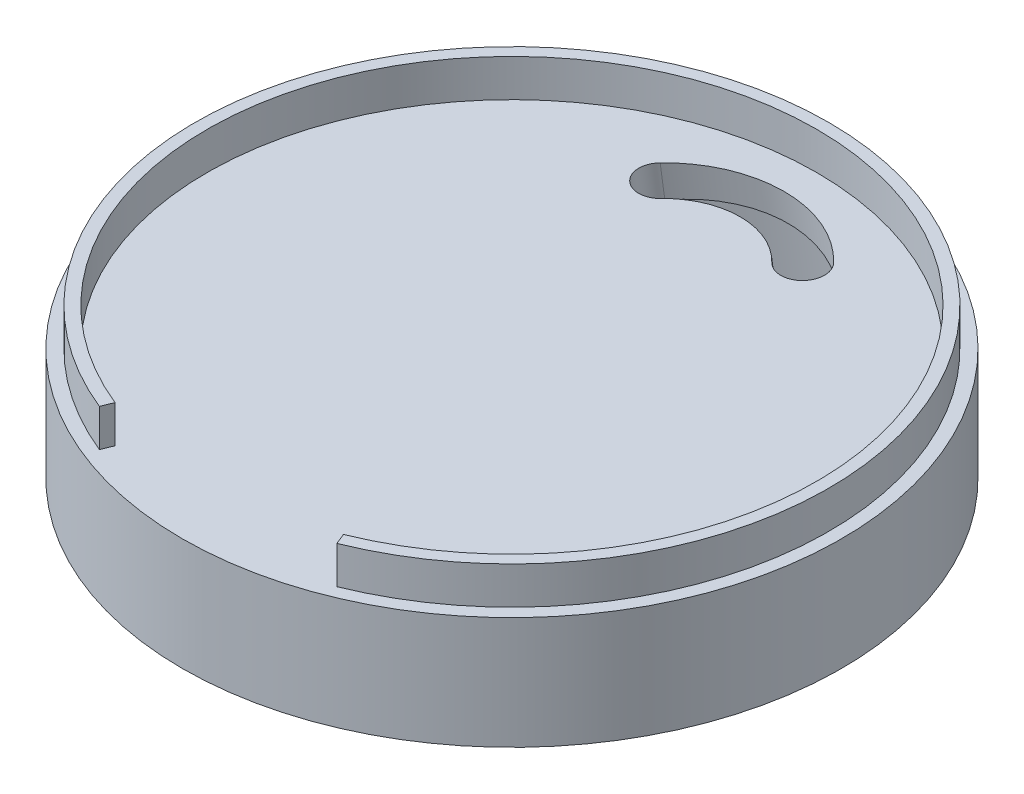
ISO-10303-21;
HEADER;
FILE_DESCRIPTION(('STEP AP214'),'2;1');
FILE_NAME('part.step','',(''),(''),'','','');
FILE_SCHEMA(('AUTOMOTIVE_DESIGN { 1 0 10303 214 1 1 1 1 }'));
ENDSEC;
DATA;
#1=APPLICATION_CONTEXT('core data for automotive mechanical design processes');
#2=APPLICATION_PROTOCOL_DEFINITION('international standard','automotive_design',2000,#1);
#3=PRODUCT_CONTEXT('',#1,'mechanical');
#4=PRODUCT('Part','Part','',(#3));
#5=PRODUCT_RELATED_PRODUCT_CATEGORY('part','',(#4));
#6=PRODUCT_DEFINITION_FORMATION('','',#4);
#7=PRODUCT_DEFINITION_CONTEXT('part definition',#1,'design');
#8=PRODUCT_DEFINITION('design','',#6,#7);
#9=PRODUCT_DEFINITION_SHAPE('','',#8);
#10=(LENGTH_UNIT() NAMED_UNIT(*) SI_UNIT(.MILLI.,.METRE.));
#11=(NAMED_UNIT(*) PLANE_ANGLE_UNIT() SI_UNIT($,.RADIAN.));
#12=(NAMED_UNIT(*) SI_UNIT($,.STERADIAN.) SOLID_ANGLE_UNIT());
#13=UNCERTAINTY_MEASURE_WITH_UNIT(LENGTH_MEASURE(1.E-05),#10,'distance_accuracy_value','');
#14=(GEOMETRIC_REPRESENTATION_CONTEXT(3) GLOBAL_UNCERTAINTY_ASSIGNED_CONTEXT((#13)) GLOBAL_UNIT_ASSIGNED_CONTEXT((#10,
#11,#12)) REPRESENTATION_CONTEXT('',''));
#15=CARTESIAN_POINT('',(0.,0.,0.));
#16=DIRECTION('',(0.,0.,1.));
#17=DIRECTION('',(1.,0.,0.));
#18=AXIS2_PLACEMENT_3D('',#15,#16,#17);
#19=CARTESIAN_POINT('',(0.,4.89963636339587,0.668132231372164));
#20=DIRECTION('',(0.,-0.990830168044299,-0.135113204733314));
#21=DIRECTION('',(0.,0.135113204733314,-0.990830168044299));
#22=AXIS2_PLACEMENT_3D('',#19,#20,#21);
#23=TOROIDAL_SURFACE('',#22,39.,1.);
#24=CARTESIAN_POINT('',(0.,5.89046653144017,0.803245436105478));
#25=DIRECTION('',(0.,-0.990830168044299,-0.135113204733314));
#26=DIRECTION('',(0.,0.135113204733314,-0.990830168044299));
#27=AXIS2_PLACEMENT_3D('',#24,#25,#26);
#28=CIRCLE('',#27,39.);
#29=CARTESIAN_POINT('',(0.,11.1598815160394,-37.8391311176222));
#30=VERTEX_POINT('',#29);
#31=EDGE_CURVE('E182',#30,#30,#28,.T.);
#32=ORIENTED_EDGE('',*,*,#31,.F.);
#33=EDGE_LOOP('',(#32));
#34=FACE_BOUND('',#33,.T.);
#35=CARTESIAN_POINT('',(-16.8813730638866,0.,36.5987988962752));
#36=CARTESIAN_POINT('',(-16.5794856015466,0.,36.7406302800024));
#37=CARTESIAN_POINT('',(-16.2756295246718,0.,36.878153996685));
#38=CARTESIAN_POINT('',(-15.6642064968074,0.,37.1446697684608));
#39=CARTESIAN_POINT('',(-15.3566396365368,0.,37.2736620316285));
#40=CARTESIAN_POINT('',(-13.8032257242076,0.,37.9002763107247));
#41=CARTESIAN_POINT('',(-12.5308241489744,0.,38.3338424882835));
#42=CARTESIAN_POINT('',(-9.94610805296166,0.,39.0676245332188));
#43=CARTESIAN_POINT('',(-8.63371943546764,0.,39.3675744448832));
#44=CARTESIAN_POINT('',(-6.14855697711686,0.,39.8077188264299));
#45=CARTESIAN_POINT('',(-4.97842457587731,0.,39.963005958262));
#46=CARTESIAN_POINT('',(-2.62882000395269,0.,40.1748158604644));
#47=CARTESIAN_POINT('',(-1.44934428849859,0.,40.2312991463402));
#48=CARTESIAN_POINT('',(0.910418579506078,0.,40.2462516535322));
#49=CARTESIAN_POINT('',(2.09070583768441,0.,40.204703782583));
#50=CARTESIAN_POINT('',(4.44370164354831,0.,40.0229049301352));
#51=CARTESIAN_POINT('',(5.6164103472022,0.,39.8826559864967));
#52=CARTESIAN_POINT('',(7.94840690090944,0.,39.50113991183));
#53=CARTESIAN_POINT('',(9.10765281673493,0.,39.2596156544282));
#54=CARTESIAN_POINT('',(11.399651440024,0.,38.6731899218117));
#55=CARTESIAN_POINT('',(12.5324130664936,0.,38.3283238053553));
#56=CARTESIAN_POINT('',(14.2042511026774,0.,37.7315226386141));
#57=CARTESIAN_POINT('',(14.7576518645712,0.,37.5190241693542));
#58=CARTESIAN_POINT('',(15.8534158146962,0.,37.0672288486971));
#59=CARTESIAN_POINT('',(16.3957797615377,0.,36.8279338465492));
#60=CARTESIAN_POINT('',(17.4684517948963,0.,36.3218840070835));
#61=CARTESIAN_POINT('',(17.9987432011531,0.,36.0550936949929));
#62=CARTESIAN_POINT('',(18.7830985071646,0.,35.6341996438728));
#63=CARTESIAN_POINT('',(19.0427437305784,0.,35.4904256767947));
#64=CARTESIAN_POINT('',(19.5580557419027,0.,35.1958907282394));
#65=CARTESIAN_POINT('',(19.8137223407993,0.,35.0451294161576));
#66=CARTESIAN_POINT('',(20.0672601141124,0.,34.8908339088547));
#67=B_SPLINE_CURVE_WITH_KNOTS('',3,(#35,#36,#37,#38,#39,#40,#41,#42,#43,#44,#45,#46,#47,#48,#49,
#50,#51,#52,#53,#54,#55,#56,#57,#58,#59,#60,#61,#62,#63,#64,#65,#66),.UNSPECIFIED.,.F.,.F.,(4,2,
2,2,2,2,2,2,2,2,2,2,2,2,2,4),(0.,1.00050383823659,2.00098326609496,6.02499713971548,
10.0569851850233,13.5939438959018,17.13231574154,20.6713045671391,24.2102203261299,
27.7581759139204,31.3049189404103,33.0827243774805,34.8604072023561,36.6404130309668,
37.5306992411513,38.4210276181205),.UNSPECIFIED.);
#68=CARTESIAN_POINT('',(-16.8813730638866,0.,36.5987988962752));
#69=VERTEX_POINT('',#68);
#70=CARTESIAN_POINT('',(16.8813730638866,0.,36.5987988962752));
#71=VERTEX_POINT('',#70);
#72=EDGE_CURVE('E11',#69,#71,#67,.T.);
#73=ORIENTED_EDGE('',*,*,#72,.F.);
#74=CARTESIAN_POINT('',(0.,4.89963636339587,0.668132231372164));
#75=DIRECTION('',(0.,-0.990830168044299,-0.135113204733314));
#76=DIRECTION('',(0.,0.135113204733314,-0.990830168044299));
#77=AXIS2_PLACEMENT_3D('',#74,#75,#76);
#78=CIRCLE('',#77,40.);
#79=EDGE_CURVE('E47',#71,#69,#78,.F.);
#80=ORIENTED_EDGE('',*,*,#79,.F.);
#81=EDGE_LOOP('',(#73,#80));
#82=FACE_BOUND('',#81,.T.);
#83=ADVANCED_FACE('F34',(#34,#82),#23,.F.);
#84=CARTESIAN_POINT('',(0.,5.89046653144017,0.803245436105478));
#85=DIRECTION('',(0.,-0.990830168044299,-0.135113204733314));
#86=DIRECTION('',(0.,0.135113204733314,-0.990830168044299));
#87=AXIS2_PLACEMENT_3D('',#84,#85,#86);
#88=PLANE('',#87);
#89=CARTESIAN_POINT('',(0.,5.89046653144017,0.803245436105478));
#90=DIRECTION('',(0.,-0.990830168044299,-0.135113204733314));
#91=DIRECTION('',(0.,0.135113204733314,-0.990830168044299));
#92=AXIS2_PLACEMENT_3D('',#89,#90,#91);
#93=CIRCLE('',#92,4.47213595499958);
#94=CARTESIAN_POINT('',(0.,6.49471115232324,-3.62788178370371));
#95=VERTEX_POINT('',#94);
#96=EDGE_CURVE('E412',#95,#95,#93,.T.);
#97=ORIENTED_EDGE('',*,*,#96,.F.);
#98=EDGE_LOOP('',(#97));
#99=FACE_BOUND('',#98,.T.);
#100=ORIENTED_EDGE('',*,*,#31,.T.);
#101=EDGE_LOOP('',(#100));
#102=FACE_BOUND('',#101,.T.);
#103=CARTESIAN_POINT('',(-9.48798461322163,10.091385007234,-30.0034900530494));
#104=DIRECTION('',(0.,-0.990830168044299,-0.135113204733314));
#105=DIRECTION('',(0.,0.135113204733314,-0.990830168044299));
#106=AXIS2_PLACEMENT_3D('',#103,#104,#105);
#107=CIRCLE('',#106,2.90577590099089);
#108=CARTESIAN_POINT('',(-7.3948638104945,9.81905969605829,-28.006437771094));
#109=VERTEX_POINT('',#108);
#110=CARTESIAN_POINT('',(-11.5811054159488,10.3637103184098,-32.0005423350049));
#111=VERTEX_POINT('',#110);
#112=EDGE_CURVE('E127',#109,#111,#107,.T.);
#113=ORIENTED_EDGE('',*,*,#112,.F.);
#114=CARTESIAN_POINT('',(0.,8.85695154364236,-20.9509779867106));
#115=DIRECTION('',(0.,0.990830168044299,0.135113204733314));
#116=DIRECTION('',(0.,0.135113204733314,-0.990830168044299));
#117=AXIS2_PLACEMENT_3D('',#114,#115,#116);
#118=CIRCLE('',#117,10.2659230292146);
#119=CARTESIAN_POINT('',(7.3948638104945,9.81905969605829,-28.006437771094));
#120=VERTEX_POINT('',#119);
#121=EDGE_CURVE('E132',#120,#109,#118,.T.);
#122=ORIENTED_EDGE('',*,*,#121,.F.);
#123=CARTESIAN_POINT('',(9.48798461322163,10.091385007234,-30.0034900530494));
#124=DIRECTION('',(0.,-0.990830168044299,-0.135113204733314));
#125=DIRECTION('',(0.,0.135113204733314,-0.990830168044299));
#126=AXIS2_PLACEMENT_3D('',#123,#124,#125);
#127=CIRCLE('',#126,2.90577590099089);
#128=CARTESIAN_POINT('',(11.5811054159488,10.3637103184098,-32.0005423350049));
#129=VERTEX_POINT('',#128);
#130=EDGE_CURVE('E111',#129,#120,#127,.T.);
#131=ORIENTED_EDGE('',*,*,#130,.F.);
#132=CARTESIAN_POINT('',(0.,8.85695154364236,-20.9509779867106));
#133=DIRECTION('',(0.,-0.990830168044299,-0.135113204733314));
#134=DIRECTION('',(0.,0.135113204733314,-0.990830168044299));
#135=AXIS2_PLACEMENT_3D('',#132,#133,#134);
#136=CIRCLE('',#135,16.0774748311964);
#137=EDGE_CURVE('E122',#111,#129,#136,.T.);
#138=ORIENTED_EDGE('',*,*,#137,.F.);
#139=EDGE_LOOP('',(#113,#122,#131,#138));
#140=FACE_BOUND('',#139,.T.);
#141=CARTESIAN_POINT('',(-14.3707878685504,4.13399486990709,13.6840376206814));
#142=DIRECTION('',(0.,-0.990830168044299,-0.135113204733314));
#143=DIRECTION('',(0.,0.135113204733314,-0.990830168044299));
#144=AXIS2_PLACEMENT_3D('',#141,#142,#143);
#145=CIRCLE('',#144,3.);
#146=CARTESIAN_POINT('',(-14.3707878685504,4.53933448410703,10.7115471165485));
#147=VERTEX_POINT('',#146);
#148=EDGE_CURVE('E416',#147,#147,#145,.T.);
#149=ORIENTED_EDGE('',*,*,#148,.F.);
#150=EDGE_LOOP('',(#149));
#151=FACE_BOUND('',#150,.T.);
#152=CARTESIAN_POINT('',(14.3707878685504,4.13399486990709,13.6840376206814));
#153=DIRECTION('',(0.,0.990830168044299,0.135113204733314));
#154=DIRECTION('',(0.,-0.135113204733314,0.990830168044299));
#155=AXIS2_PLACEMENT_3D('',#152,#153,#154);
#156=CIRCLE('',#155,3.);
#157=CARTESIAN_POINT('',(14.3707878685504,3.72865525570715,16.6565281248143));
#158=VERTEX_POINT('',#157);
#159=EDGE_CURVE('E422',#158,#158,#156,.T.);
#160=ORIENTED_EDGE('',*,*,#159,.T.);
#161=EDGE_LOOP('',(#160));
#162=FACE_BOUND('',#161,.T.);
#163=ADVANCED_FACE('F129',(#99,#102,#140,#151,#162),#88,.T.);
#164=CARTESIAN_POINT('',(0.,15.,0.));
#165=DIRECTION('',(0.,1.,0.));
#166=DIRECTION('',(0.,0.,1.));
#167=AXIS2_PLACEMENT_3D('',#164,#165,#166);
#168=PLANE('',#167);
#169=CARTESIAN_POINT('',(-9.48798461322163,15.,-29.3341334631268));
#170=DIRECTION('',(0.,1.,0.));
#171=DIRECTION('',(0.,0.,-1.));
#172=AXIS2_PLACEMENT_3D('',#169,#170,#171);
#173=ELLIPSE('',#172,2.93266797348966,2.90577590099089);
#174=CARTESIAN_POINT('',(-11.5811054159488,15.,-31.368321014788));
#175=VERTEX_POINT('',#174);
#176=CARTESIAN_POINT('',(-7.3948638104945,15.,-27.2999459114656));
#177=VERTEX_POINT('',#176);
#178=EDGE_CURVE('E146',#175,#177,#173,.T.);
#179=ORIENTED_EDGE('',*,*,#178,.F.);
#180=CARTESIAN_POINT('',(0.,15.,-20.1132895608436));
#181=DIRECTION('',(0.,1.,0.));
#182=DIRECTION('',(0.,0.,-1.));
#183=AXIS2_PLACEMENT_3D('',#180,#181,#182);
#184=ELLIPSE('',#183,16.2262669726035,16.0774748311964);
#185=CARTESIAN_POINT('',(11.5811054159488,15.,-31.368321014788));
#186=VERTEX_POINT('',#185);
#187=EDGE_CURVE('E139',#186,#175,#184,.T.);
#188=ORIENTED_EDGE('',*,*,#187,.F.);
#189=CARTESIAN_POINT('',(9.48798461322163,15.,-29.3341334631268));
#190=DIRECTION('',(0.,1.,0.));
#191=DIRECTION('',(0.,0.,-1.));
#192=AXIS2_PLACEMENT_3D('',#189,#190,#191);
#193=ELLIPSE('',#192,2.93266797348966,2.90577590099089);
#194=CARTESIAN_POINT('',(7.3948638104945,15.,-27.2999459114656));
#195=VERTEX_POINT('',#194);
#196=EDGE_CURVE('E114',#195,#186,#193,.T.);
#197=ORIENTED_EDGE('',*,*,#196,.F.);
#198=CARTESIAN_POINT('',(0.,15.,-20.1132895608436));
#199=DIRECTION('',(0.,1.,0.));
#200=DIRECTION('',(0.,0.,-1.));
#201=AXIS2_PLACEMENT_3D('',#198,#199,#200);
#202=ELLIPSE('',#201,10.3609310256242,10.2659230292146);
#203=EDGE_CURVE('E144',#177,#195,#202,.F.);
#204=ORIENTED_EDGE('',*,*,#203,.F.);
#205=EDGE_LOOP('',(#179,#188,#197,#204));
#206=FACE_BOUND('',#205,.T.);
#207=CARTESIAN_POINT('',(0.,15.,0.));
#208=DIRECTION('',(0.,1.,0.));
#209=DIRECTION('',(0.,0.,1.));
#210=AXIS2_PLACEMENT_3D('',#207,#208,#209);
#211=CIRCLE('',#210,44.);
#212=CARTESIAN_POINT('',(0.,15.,44.));
#213=VERTEX_POINT('',#212);
#214=EDGE_CURVE('E179',#213,#213,#211,.T.);
#215=ORIENTED_EDGE('',*,*,#214,.T.);
#216=EDGE_LOOP('',(#215));
#217=FACE_BOUND('',#216,.T.);
#218=DIRECTION('',(0.374606593415913,0.,0.927183854566787));
#219=VECTOR('',#218,1.);
#220=CARTESIAN_POINT('',(15.2464883520277,15.,37.7363828808682));
#221=LINE('',#220,#219);
#222=CARTESIAN_POINT('',(15.2464883520277,15.,37.7363828808682));
#223=VERTEX_POINT('',#222);
#224=CARTESIAN_POINT('',(15.8458589014931,15.,39.2198770481751));
#225=VERTEX_POINT('',#224);
#226=EDGE_CURVE('E163',#223,#225,#221,.T.);
#227=ORIENTED_EDGE('',*,*,#226,.F.);
#228=CARTESIAN_POINT('',(0.,15.,0.));
#229=DIRECTION('',(0.,-1.,0.));
#230=DIRECTION('',(0.,0.,1.));
#231=AXIS2_PLACEMENT_3D('',#228,#229,#230);
#232=CIRCLE('',#231,40.7);
#233=CARTESIAN_POINT('',(-15.2464883520276,15.,37.7363828808682));
#234=VERTEX_POINT('',#233);
#235=EDGE_CURVE('E160',#234,#223,#232,.T.);
#236=ORIENTED_EDGE('',*,*,#235,.F.);
#237=DIRECTION('',(0.374606593415912,0.,-0.927183854566788));
#238=VECTOR('',#237,1.);
#239=CARTESIAN_POINT('',(-15.2464883520276,15.,37.7363828808682));
#240=LINE('',#239,#238);
#241=CARTESIAN_POINT('',(-15.8458589014931,15.,39.2198770481751));
#242=VERTEX_POINT('',#241);
#243=EDGE_CURVE('E153',#242,#234,#240,.T.);
#244=ORIENTED_EDGE('',*,*,#243,.F.);
#245=CARTESIAN_POINT('',(0.,15.,0.));
#246=DIRECTION('',(0.,1.,0.));
#247=DIRECTION('',(0.,0.,1.));
#248=AXIS2_PLACEMENT_3D('',#245,#246,#247);
#249=CIRCLE('',#248,42.3);
#250=EDGE_CURVE('E165',#225,#242,#249,.T.);
#251=ORIENTED_EDGE('',*,*,#250,.F.);
#252=EDGE_LOOP('',(#227,#236,#244,#251));
#253=FACE_BOUND('',#252,.T.);
#254=ADVANCED_FACE('F198',(#206,#217,#253),#168,.T.);
#255=CARTESIAN_POINT('',(0.,15.,0.));
#256=DIRECTION('',(0.,-1.,0.));
#257=DIRECTION('',(0.,0.,-1.));
#258=AXIS2_PLACEMENT_3D('',#255,#256,#257);
#259=CYLINDRICAL_SURFACE('',#258,44.);
#260=ORIENTED_EDGE('',*,*,#214,.F.);
#261=EDGE_LOOP('',(#260));
#262=FACE_BOUND('',#261,.T.);
#263=CARTESIAN_POINT('',(0.,0.,0.));
#264=DIRECTION('',(0.,1.,0.));
#265=DIRECTION('',(0.,0.,1.));
#266=AXIS2_PLACEMENT_3D('',#263,#264,#265);
#267=CIRCLE('',#266,44.);
#268=CARTESIAN_POINT('',(0.,0.,44.));
#269=VERTEX_POINT('',#268);
#270=EDGE_CURVE('E178',#269,#269,#267,.T.);
#271=ORIENTED_EDGE('',*,*,#270,.T.);
#272=EDGE_LOOP('',(#271));
#273=FACE_BOUND('',#272,.T.);
#274=ADVANCED_FACE('F194',(#262,#273),#259,.T.);
#275=CARTESIAN_POINT('',(0.,0.,0.));
#276=DIRECTION('',(0.,1.,0.));
#277=DIRECTION('',(0.,0.,1.));
#278=AXIS2_PLACEMENT_3D('',#275,#276,#277);
#279=PLANE('',#278);
#280=CARTESIAN_POINT('',(0.,0.,0.));
#281=DIRECTION('',(0.,1.,0.));
#282=DIRECTION('',(0.,0.,1.));
#283=AXIS2_PLACEMENT_3D('',#280,#281,#282);
#284=ELLIPSE('',#283,40.3701878384991,40.);
#285=EDGE_CURVE('E148',#69,#71,#284,.F.);
#286=ORIENTED_EDGE('',*,*,#285,.F.);
#287=ORIENTED_EDGE('',*,*,#72,.T.);
#288=EDGE_LOOP('',(#286,#287));
#289=FACE_BOUND('',#288,.T.);
#290=ORIENTED_EDGE('',*,*,#270,.F.);
#291=EDGE_LOOP('',(#290));
#292=FACE_BOUND('',#291,.T.);
#293=ADVANCED_FACE('F190',(#289,#292),#279,.F.);
#294=CARTESIAN_POINT('',(0.,20.,0.));
#295=DIRECTION('',(0.,-1.,0.));
#296=DIRECTION('',(0.,0.,-1.));
#297=AXIS2_PLACEMENT_3D('',#294,#295,#296);
#298=CYLINDRICAL_SURFACE('',#297,40.7);
#299=ORIENTED_EDGE('',*,*,#235,.T.);
#300=DIRECTION('',(0.,-1.,0.));
#301=VECTOR('',#300,1.);
#302=CARTESIAN_POINT('',(15.2464883520277,20.,37.7363828808682));
#303=LINE('',#302,#301);
#304=CARTESIAN_POINT('',(15.2464883520277,20.,37.7363828808682));
#305=VERTEX_POINT('',#304);
#306=EDGE_CURVE('E176',#305,#223,#303,.T.);
#307=ORIENTED_EDGE('',*,*,#306,.F.);
#308=CARTESIAN_POINT('',(0.,20.,0.));
#309=DIRECTION('',(0.,-1.,0.));
#310=DIRECTION('',(0.,0.,1.));
#311=AXIS2_PLACEMENT_3D('',#308,#309,#310);
#312=CIRCLE('',#311,40.7);
#313=CARTESIAN_POINT('',(-15.2464883520276,20.,37.7363828808682));
#314=VERTEX_POINT('',#313);
#315=EDGE_CURVE('E149',#314,#305,#312,.T.);
#316=ORIENTED_EDGE('',*,*,#315,.F.);
#317=DIRECTION('',(0.,-1.,0.));
#318=VECTOR('',#317,1.);
#319=CARTESIAN_POINT('',(-15.2464883520276,20.,37.7363828808682));
#320=LINE('',#319,#318);
#321=EDGE_CURVE('E159',#314,#234,#320,.T.);
#322=ORIENTED_EDGE('',*,*,#321,.T.);
#323=EDGE_LOOP('',(#299,#307,#316,#322));
#324=FACE_BOUND('',#323,.T.);
#325=ADVANCED_FACE('F193',(#324),#298,.F.);
#326=CARTESIAN_POINT('',(15.2464883520277,20.,37.7363828808682));
#327=DIRECTION('',(0.927183854566787,0.,-0.374606593415913));
#328=DIRECTION('',(-0.374606593415914,0.,-0.927183854566787));
#329=AXIS2_PLACEMENT_3D('',#326,#327,#328);
#330=PLANE('',#329);
#331=ORIENTED_EDGE('',*,*,#226,.T.);
#332=DIRECTION('',(0.,-1.,0.));
#333=VECTOR('',#332,1.);
#334=CARTESIAN_POINT('',(15.8458589014931,20.,39.2198770481751));
#335=LINE('',#334,#333);
#336=CARTESIAN_POINT('',(15.8458589014931,20.,39.2198770481751));
#337=VERTEX_POINT('',#336);
#338=EDGE_CURVE('E173',#337,#225,#335,.T.);
#339=ORIENTED_EDGE('',*,*,#338,.F.);
#340=DIRECTION('',(0.374606593415913,0.,0.927183854566787));
#341=VECTOR('',#340,1.);
#342=CARTESIAN_POINT('',(15.2464883520277,20.,37.7363828808682));
#343=LINE('',#342,#341);
#344=EDGE_CURVE('E152',#305,#337,#343,.T.);
#345=ORIENTED_EDGE('',*,*,#344,.F.);
#346=ORIENTED_EDGE('',*,*,#306,.T.);
#347=EDGE_LOOP('',(#331,#339,#345,#346));
#348=FACE_BOUND('',#347,.T.);
#349=ADVANCED_FACE('F235',(#348),#330,.F.);
#350=CARTESIAN_POINT('',(0.,20.,0.));
#351=DIRECTION('',(0.,-1.,0.));
#352=DIRECTION('',(0.,0.,-1.));
#353=AXIS2_PLACEMENT_3D('',#350,#351,#352);
#354=CYLINDRICAL_SURFACE('',#353,42.3);
#355=ORIENTED_EDGE('',*,*,#250,.T.);
#356=DIRECTION('',(0.,-1.,0.));
#357=VECTOR('',#356,1.);
#358=CARTESIAN_POINT('',(-15.8458589014931,20.,39.2198770481751));
#359=LINE('',#358,#357);
#360=CARTESIAN_POINT('',(-15.8458589014931,20.,39.2198770481751));
#361=VERTEX_POINT('',#360);
#362=EDGE_CURVE('E171',#361,#242,#359,.T.);
#363=ORIENTED_EDGE('',*,*,#362,.F.);
#364=CARTESIAN_POINT('',(0.,20.,0.));
#365=DIRECTION('',(0.,1.,0.));
#366=DIRECTION('',(0.,0.,1.));
#367=AXIS2_PLACEMENT_3D('',#364,#365,#366);
#368=CIRCLE('',#367,42.3);
#369=EDGE_CURVE('E155',#337,#361,#368,.T.);
#370=ORIENTED_EDGE('',*,*,#369,.F.);
#371=ORIENTED_EDGE('',*,*,#338,.T.);
#372=EDGE_LOOP('',(#355,#363,#370,#371));
#373=FACE_BOUND('',#372,.T.);
#374=ADVANCED_FACE('F231',(#373),#354,.T.);
#375=CARTESIAN_POINT('',(-15.2464883520276,20.,37.7363828808682));
#376=DIRECTION('',(-0.927183854566788,0.,-0.374606593415912));
#377=DIRECTION('',(-0.374606593415912,0.,0.927183854566788));
#378=AXIS2_PLACEMENT_3D('',#375,#376,#377);
#379=PLANE('',#378);
#380=ORIENTED_EDGE('',*,*,#243,.T.);
#381=ORIENTED_EDGE('',*,*,#321,.F.);
#382=DIRECTION('',(0.374606593415912,0.,-0.927183854566788));
#383=VECTOR('',#382,1.);
#384=CARTESIAN_POINT('',(-15.2464883520276,20.,37.7363828808682));
#385=LINE('',#384,#383);
#386=EDGE_CURVE('E157',#361,#314,#385,.T.);
#387=ORIENTED_EDGE('',*,*,#386,.F.);
#388=ORIENTED_EDGE('',*,*,#362,.T.);
#389=EDGE_LOOP('',(#380,#381,#387,#388));
#390=FACE_BOUND('',#389,.T.);
#391=ADVANCED_FACE('F227',(#390),#379,.F.);
#392=CARTESIAN_POINT('',(0.,20.,0.));
#393=DIRECTION('',(0.,1.,0.));
#394=DIRECTION('',(0.,0.,1.));
#395=AXIS2_PLACEMENT_3D('',#392,#393,#394);
#396=PLANE('',#395);
#397=ORIENTED_EDGE('',*,*,#315,.T.);
#398=ORIENTED_EDGE('',*,*,#344,.T.);
#399=ORIENTED_EDGE('',*,*,#369,.T.);
#400=ORIENTED_EDGE('',*,*,#386,.T.);
#401=EDGE_LOOP('',(#397,#398,#399,#400));
#402=FACE_BOUND('',#401,.T.);
#403=ADVANCED_FACE('F224',(#402),#396,.T.);
#404=CARTESIAN_POINT('',(0.,-13.9261368294458,-1.89901865856079));
#405=DIRECTION('',(0.,0.990830168044299,0.135113204733314));
#406=DIRECTION('',(0.,-0.135113204733314,0.990830168044299));
#407=AXIS2_PLACEMENT_3D('',#404,#405,#406);
#408=CYLINDRICAL_SURFACE('',#407,40.);
#409=ORIENTED_EDGE('',*,*,#285,.T.);
#410=ORIENTED_EDGE('',*,*,#79,.T.);
#411=EDGE_LOOP('',(#409,#410));
#412=FACE_BOUND('',#411,.T.);
#413=ADVANCED_FACE('F189',(#412),#408,.F.);
#414=CARTESIAN_POINT('',(-9.48798461322163,19.999686687677,-28.6523580057163));
#415=DIRECTION('',(0.,-0.990830168044299,-0.135113204733314));
#416=DIRECTION('',(0.,0.135113204733314,-0.990830168044299));
#417=AXIS2_PLACEMENT_3D('',#414,#415,#416);
#418=CYLINDRICAL_SURFACE('',#417,2.90577590099089);
#419=ORIENTED_EDGE('',*,*,#178,.T.);
#420=DIRECTION('',(0.,-0.990830168044299,-0.135113204733314));
#421=VECTOR('',#420,1.);
#422=CARTESIAN_POINT('',(-7.3948638104945,19.7273613765013,-26.6553057237609));
#423=LINE('',#422,#421);
#424=EDGE_CURVE('E137',#177,#109,#423,.T.);
#425=ORIENTED_EDGE('',*,*,#424,.T.);
#426=ORIENTED_EDGE('',*,*,#112,.T.);
#427=DIRECTION('',(0.,-0.990830168044299,-0.135113204733314));
#428=VECTOR('',#427,1.);
#429=CARTESIAN_POINT('',(-11.5811054159488,20.2720119988528,-30.6494102876717));
#430=LINE('',#429,#428);
#431=EDGE_CURVE('E118',#175,#111,#430,.T.);
#432=ORIENTED_EDGE('',*,*,#431,.F.);
#433=EDGE_LOOP('',(#419,#425,#426,#432));
#434=FACE_BOUND('',#433,.T.);
#435=ADVANCED_FACE('F220',(#434),#418,.F.);
#436=CARTESIAN_POINT('',(0.,18.7652532240853,-19.5998459393774));
#437=DIRECTION('',(0.,-0.990830168044299,-0.135113204733314));
#438=DIRECTION('',(0.,0.135113204733314,-0.990830168044299));
#439=AXIS2_PLACEMENT_3D('',#436,#437,#438);
#440=CYLINDRICAL_SURFACE('',#439,10.2659230292146);
#441=ORIENTED_EDGE('',*,*,#203,.T.);
#442=DIRECTION('',(0.,-0.990830168044299,-0.135113204733314));
#443=VECTOR('',#442,1.);
#444=CARTESIAN_POINT('',(7.3948638104945,19.7273613765013,-26.6553057237609));
#445=LINE('',#444,#443);
#446=EDGE_CURVE('E117',#195,#120,#445,.T.);
#447=ORIENTED_EDGE('',*,*,#446,.T.);
#448=ORIENTED_EDGE('',*,*,#121,.T.);
#449=ORIENTED_EDGE('',*,*,#424,.F.);
#450=EDGE_LOOP('',(#441,#447,#448,#449));
#451=FACE_BOUND('',#450,.T.);
#452=ADVANCED_FACE('F287',(#451),#440,.T.);
#453=CARTESIAN_POINT('',(9.48798461322163,19.999686687677,-28.6523580057163));
#454=DIRECTION('',(0.,-0.990830168044299,-0.135113204733314));
#455=DIRECTION('',(0.,0.135113204733314,-0.990830168044299));
#456=AXIS2_PLACEMENT_3D('',#453,#454,#455);
#457=CYLINDRICAL_SURFACE('',#456,2.90577590099089);
#458=ORIENTED_EDGE('',*,*,#196,.T.);
#459=DIRECTION('',(0.,-0.990830168044299,-0.135113204733314));
#460=VECTOR('',#459,1.);
#461=CARTESIAN_POINT('',(11.5811054159488,20.2720119988528,-30.6494102876717));
#462=LINE('',#461,#460);
#463=EDGE_CURVE('E106',#186,#129,#462,.T.);
#464=ORIENTED_EDGE('',*,*,#463,.T.);
#465=ORIENTED_EDGE('',*,*,#130,.T.);
#466=ORIENTED_EDGE('',*,*,#446,.F.);
#467=EDGE_LOOP('',(#458,#464,#465,#466));
#468=FACE_BOUND('',#467,.T.);
#469=ADVANCED_FACE('F108',(#468),#457,.F.);
#470=CARTESIAN_POINT('',(0.,18.7652532240853,-19.5998459393774));
#471=DIRECTION('',(0.,-0.990830168044299,-0.135113204733314));
#472=DIRECTION('',(0.,0.135113204733314,-0.990830168044299));
#473=AXIS2_PLACEMENT_3D('',#470,#471,#472);
#474=CYLINDRICAL_SURFACE('',#473,16.0774748311964);
#475=ORIENTED_EDGE('',*,*,#187,.T.);
#476=ORIENTED_EDGE('',*,*,#431,.T.);
#477=ORIENTED_EDGE('',*,*,#137,.T.);
#478=ORIENTED_EDGE('',*,*,#463,.F.);
#479=EDGE_LOOP('',(#475,#476,#477,#478));
#480=FACE_BOUND('',#479,.T.);
#481=ADVANCED_FACE('F123',(#480),#474,.F.);
#482=CARTESIAN_POINT('',(-14.3707878685504,7.10648537403999,14.0893772348813));
#483=DIRECTION('',(0.,-0.990830168044299,-0.135113204733314));
#484=DIRECTION('',(0.,0.135113204733314,-0.990830168044299));
#485=AXIS2_PLACEMENT_3D('',#482,#483,#484);
#486=CYLINDRICAL_SURFACE('',#485,3.);
#487=CARTESIAN_POINT('',(-14.3707878685504,7.10648537403999,14.0893772348813));
#488=DIRECTION('',(0.,-0.990830168044299,-0.135113204733314));
#489=DIRECTION('',(0.,0.135113204733314,-0.990830168044299));
#490=AXIS2_PLACEMENT_3D('',#487,#488,#489);
#491=CIRCLE('',#490,3.);
#492=CARTESIAN_POINT('',(-14.3707878685504,7.51182498823993,11.1168867307484));
#493=VERTEX_POINT('',#492);
#494=EDGE_CURVE('E413',#493,#493,#491,.T.);
#495=ORIENTED_EDGE('',*,*,#494,.F.);
#496=EDGE_LOOP('',(#495));
#497=FACE_BOUND('',#496,.T.);
#498=ORIENTED_EDGE('',*,*,#148,.T.);
#499=EDGE_LOOP('',(#498));
#500=FACE_BOUND('',#499,.T.);
#501=ADVANCED_FACE('F307',(#497,#500),#486,.F.);
#502=CARTESIAN_POINT('',(-14.3707878685504,7.10648537403999,14.0893772348813));
#503=DIRECTION('',(0.,-0.990830168044299,-0.135113204733314));
#504=DIRECTION('',(0.,0.135113204733314,-0.990830168044299));
#505=AXIS2_PLACEMENT_3D('',#502,#503,#504);
#506=PLANE('',#505);
#507=ORIENTED_EDGE('',*,*,#494,.T.);
#508=EDGE_LOOP('',(#507));
#509=FACE_BOUND('',#508,.T.);
#510=ADVANCED_FACE('F313',(#509),#506,.T.);
#511=CARTESIAN_POINT('',(14.3707878685504,7.10648537403999,14.0893772348813));
#512=DIRECTION('',(0.,-0.990830168044299,-0.135113204733314));
#513=DIRECTION('',(0.,0.135113204733314,-0.990830168044299));
#514=AXIS2_PLACEMENT_3D('',#511,#512,#513);
#515=CYLINDRICAL_SURFACE('',#514,3.);
#516=CARTESIAN_POINT('',(14.3707878685504,7.10648537403999,14.0893772348813));
#517=DIRECTION('',(0.,0.990830168044299,0.135113204733314));
#518=DIRECTION('',(0.,-0.135113204733314,0.990830168044299));
#519=AXIS2_PLACEMENT_3D('',#516,#517,#518);
#520=CIRCLE('',#519,3.);
#521=CARTESIAN_POINT('',(14.3707878685504,6.70114575984005,17.0618677390142));
#522=VERTEX_POINT('',#521);
#523=EDGE_CURVE('E419',#522,#522,#520,.T.);
#524=ORIENTED_EDGE('',*,*,#523,.T.);
#525=EDGE_LOOP('',(#524));
#526=FACE_BOUND('',#525,.T.);
#527=ORIENTED_EDGE('',*,*,#159,.F.);
#528=EDGE_LOOP('',(#527));
#529=FACE_BOUND('',#528,.T.);
#530=ADVANCED_FACE('F321',(#526,#529),#515,.F.);
#531=CARTESIAN_POINT('',(14.3707878685504,7.10648537403999,14.0893772348813));
#532=DIRECTION('',(0.,0.990830168044299,0.135113204733314));
#533=DIRECTION('',(0.,-0.135113204733314,0.990830168044299));
#534=AXIS2_PLACEMENT_3D('',#531,#532,#533);
#535=PLANE('',#534);
#536=ORIENTED_EDGE('',*,*,#523,.F.);
#537=EDGE_LOOP('',(#536));
#538=FACE_BOUND('',#537,.T.);
#539=ADVANCED_FACE('F329',(#538),#535,.F.);
#540=CARTESIAN_POINT('',(0.,1.92714585926297,0.262792617172224));
#541=DIRECTION('',(0.,-0.990830168044299,-0.135113204733314));
#542=DIRECTION('',(1.,0.,0.));
#543=AXIS2_PLACEMENT_3D('',#540,#541,#542);
#544=SPHERICAL_SURFACE('',#543,6.);
#545=ORIENTED_EDGE('',*,*,#96,.T.);
#546=EDGE_LOOP('',(#545));
#547=FACE_BOUND('',#546,.T.);
#548=ADVANCED_FACE('F337',(#547),#544,.T.);
#549=CLOSED_SHELL('',(#83,#163,#254,#274,#293,#325,#349,#374,#391,#403,#413,#435,#452,#469,#481,
#501,#510,#530,#539,#548));
#550=MANIFOLD_SOLID_BREP('B2',#549);
#551=ADVANCED_BREP_SHAPE_REPRESENTATION('',(#18,#550),#14);
#552=SHAPE_DEFINITION_REPRESENTATION(#9,#551);
ENDSEC;
END-ISO-10303-21;
